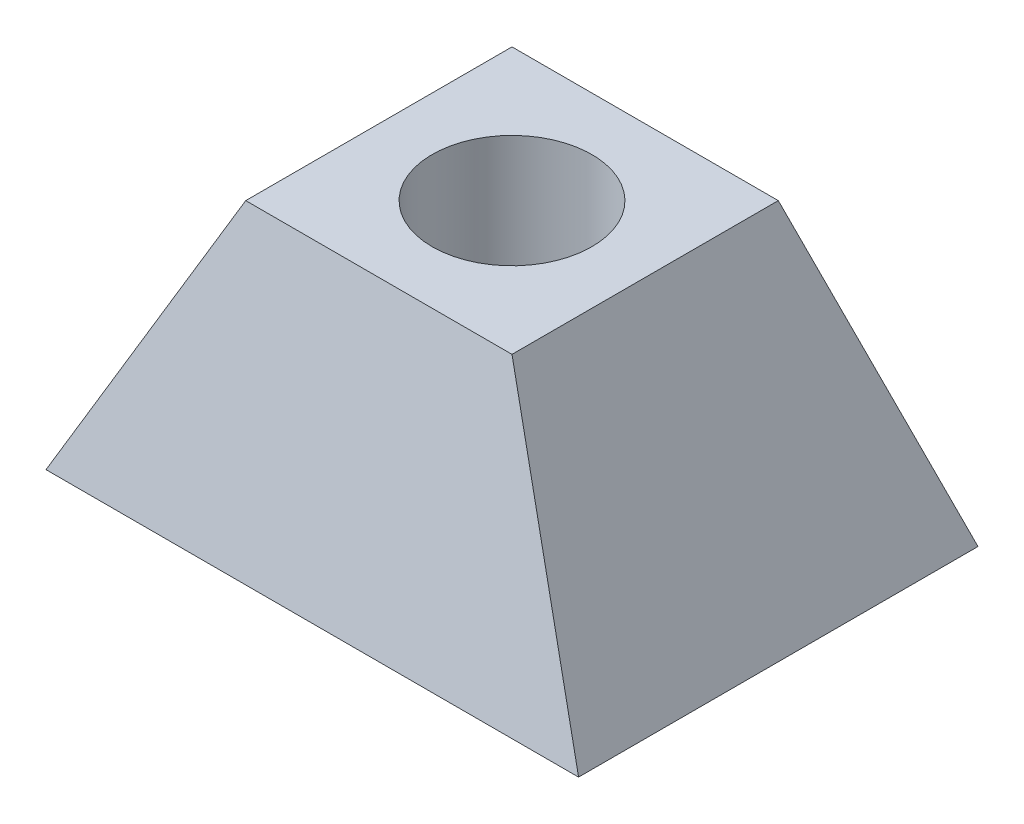
ISO-10303-21;
HEADER;
FILE_DESCRIPTION(('STEP AP214'),'2;1');
FILE_NAME('part.step','',(''),(''),'','','');
FILE_SCHEMA(('AUTOMOTIVE_DESIGN { 1 0 10303 214 1 1 1 1 }'));
ENDSEC;
DATA;
#1=APPLICATION_CONTEXT('core data for automotive mechanical design processes');
#2=APPLICATION_PROTOCOL_DEFINITION('international standard','automotive_design',2000,#1);
#3=PRODUCT_CONTEXT('',#1,'mechanical');
#4=PRODUCT('Part','Part','',(#3));
#5=PRODUCT_RELATED_PRODUCT_CATEGORY('part','',(#4));
#6=PRODUCT_DEFINITION_FORMATION('','',#4);
#7=PRODUCT_DEFINITION_CONTEXT('part definition',#1,'design');
#8=PRODUCT_DEFINITION('design','',#6,#7);
#9=PRODUCT_DEFINITION_SHAPE('','',#8);
#10=(LENGTH_UNIT() NAMED_UNIT(*) SI_UNIT(.MILLI.,.METRE.));
#11=(NAMED_UNIT(*) PLANE_ANGLE_UNIT() SI_UNIT($,.RADIAN.));
#12=(NAMED_UNIT(*) SI_UNIT($,.STERADIAN.) SOLID_ANGLE_UNIT());
#13=UNCERTAINTY_MEASURE_WITH_UNIT(LENGTH_MEASURE(1.E-05),#10,'distance_accuracy_value','');
#14=(GEOMETRIC_REPRESENTATION_CONTEXT(3) GLOBAL_UNCERTAINTY_ASSIGNED_CONTEXT((#13)) GLOBAL_UNIT_ASSIGNED_CONTEXT((#10,
#11,#12)) REPRESENTATION_CONTEXT('',''));
#15=CARTESIAN_POINT('',(0.,0.,0.));
#16=DIRECTION('',(0.,0.,1.));
#17=DIRECTION('',(1.,0.,0.));
#18=AXIS2_PLACEMENT_3D('',#15,#16,#17);
#19=CARTESIAN_POINT('',(0.,12.7,0.));
#20=DIRECTION('',(0.,-1.,0.));
#21=DIRECTION('',(0.,0.,-1.));
#22=AXIS2_PLACEMENT_3D('',#19,#20,#21);
#23=PLANE('',#22);
#24=CARTESIAN_POINT('',(0.,12.7,0.));
#25=DIRECTION('',(0.,1.,0.));
#26=DIRECTION('',(0.,0.,1.));
#27=AXIS2_PLACEMENT_3D('',#24,#25,#26);
#28=CIRCLE('',#27,3.81);
#29=CARTESIAN_POINT('',(0.,12.7,3.81));
#30=VERTEX_POINT('',#29);
#31=EDGE_CURVE('E264',#30,#30,#28,.T.);
#32=ORIENTED_EDGE('',*,*,#31,.F.);
#33=EDGE_LOOP('',(#32));
#34=FACE_BOUND('',#33,.T.);
#35=DIRECTION('',(0.,0.,-1.));
#36=VECTOR('',#35,1.);
#37=CARTESIAN_POINT('',(6.35,12.7,6.35));
#38=LINE('',#37,#36);
#39=CARTESIAN_POINT('',(6.35,12.7,6.35));
#40=VERTEX_POINT('',#39);
#41=CARTESIAN_POINT('',(6.35,12.7,-6.35));
#42=VERTEX_POINT('',#41);
#43=EDGE_CURVE('E224',#40,#42,#38,.T.);
#44=ORIENTED_EDGE('',*,*,#43,.T.);
#45=DIRECTION('',(-1.,0.,0.));
#46=VECTOR('',#45,1.);
#47=CARTESIAN_POINT('',(-6.35,12.7,-6.35));
#48=LINE('',#47,#46);
#49=CARTESIAN_POINT('',(-6.35,12.7,-6.35));
#50=VERTEX_POINT('',#49);
#51=EDGE_CURVE('E218',#42,#50,#48,.T.);
#52=ORIENTED_EDGE('',*,*,#51,.T.);
#53=DIRECTION('',(0.,0.,1.));
#54=VECTOR('',#53,1.);
#55=CARTESIAN_POINT('',(-6.35,12.7,6.35));
#56=LINE('',#55,#54);
#57=CARTESIAN_POINT('',(-6.35,12.7,6.35));
#58=VERTEX_POINT('',#57);
#59=EDGE_CURVE('E56',#50,#58,#56,.T.);
#60=ORIENTED_EDGE('',*,*,#59,.T.);
#61=DIRECTION('',(1.,0.,0.));
#62=VECTOR('',#61,1.);
#63=CARTESIAN_POINT('',(-6.35,12.7,6.35));
#64=LINE('',#63,#62);
#65=EDGE_CURVE('E12',#58,#40,#64,.T.);
#66=ORIENTED_EDGE('',*,*,#65,.T.);
#67=EDGE_LOOP('',(#44,#52,#60,#66));
#68=FACE_BOUND('',#67,.T.);
#69=ADVANCED_FACE('F47',(#34,#68),#23,.F.);
#70=CARTESIAN_POINT('',(0.,0.,0.));
#71=DIRECTION('',(0.,-1.,0.));
#72=DIRECTION('',(0.,0.,-1.));
#73=AXIS2_PLACEMENT_3D('',#70,#71,#72);
#74=PLANE('',#73);
#75=CARTESIAN_POINT('',(0.,0.,0.));
#76=DIRECTION('',(0.,-1.,0.));
#77=DIRECTION('',(0.,0.,-1.));
#78=AXIS2_PLACEMENT_3D('',#75,#76,#77);
#79=CIRCLE('',#78,3.81);
#80=CARTESIAN_POINT('',(0.,0.,3.81));
#81=VERTEX_POINT('',#80);
#82=EDGE_CURVE('E51',#81,#81,#79,.T.);
#83=ORIENTED_EDGE('',*,*,#82,.F.);
#84=EDGE_LOOP('',(#83));
#85=FACE_BOUND('',#84,.T.);
#86=DIRECTION('',(0.,0.,-1.));
#87=VECTOR('',#86,1.);
#88=CARTESIAN_POINT('',(12.7,0.,9.525));
#89=LINE('',#88,#87);
#90=CARTESIAN_POINT('',(12.7,0.,9.525));
#91=VERTEX_POINT('',#90);
#92=CARTESIAN_POINT('',(12.7,0.,-9.525));
#93=VERTEX_POINT('',#92);
#94=EDGE_CURVE('E114',#91,#93,#89,.T.);
#95=ORIENTED_EDGE('',*,*,#94,.F.);
#96=DIRECTION('',(1.,0.,0.));
#97=VECTOR('',#96,1.);
#98=CARTESIAN_POINT('',(-12.7,0.,9.525));
#99=LINE('',#98,#97);
#100=CARTESIAN_POINT('',(-12.7,0.,9.525));
#101=VERTEX_POINT('',#100);
#102=EDGE_CURVE('E98',#101,#91,#99,.T.);
#103=ORIENTED_EDGE('',*,*,#102,.F.);
#104=DIRECTION('',(0.,0.,1.));
#105=VECTOR('',#104,1.);
#106=CARTESIAN_POINT('',(-12.7,0.,9.525));
#107=LINE('',#106,#105);
#108=CARTESIAN_POINT('',(-12.7,0.,-9.525));
#109=VERTEX_POINT('',#108);
#110=EDGE_CURVE('E89',#109,#101,#107,.T.);
#111=ORIENTED_EDGE('',*,*,#110,.F.);
#112=DIRECTION('',(-1.,0.,0.));
#113=VECTOR('',#112,1.);
#114=CARTESIAN_POINT('',(-12.7,0.,-9.525));
#115=LINE('',#114,#113);
#116=EDGE_CURVE('E94',#93,#109,#115,.T.);
#117=ORIENTED_EDGE('',*,*,#116,.F.);
#118=EDGE_LOOP('',(#95,#103,#111,#117));
#119=FACE_BOUND('',#118,.T.);
#120=ADVANCED_FACE('F93',(#85,#119),#74,.T.);
#121=CARTESIAN_POINT('',(0.,2.24117647058823,-8.96470588235294));
#122=DIRECTION('',(0.,-0.242535625036333,0.970142500145332));
#123=DIRECTION('',(0.,-0.970142500145332,-0.242535625036333));
#124=AXIS2_PLACEMENT_3D('',#121,#122,#123);
#125=PLANE('',#124);
#126=DIRECTION('',(0.436435780471985,0.872871560943969,0.218217890235992));
#127=VECTOR('',#126,1.);
#128=CARTESIAN_POINT('',(-12.7,0.,-9.525));
#129=LINE('',#128,#127);
#130=EDGE_CURVE('E110',#109,#50,#129,.T.);
#131=ORIENTED_EDGE('',*,*,#130,.T.);
#132=ORIENTED_EDGE('',*,*,#51,.F.);
#133=DIRECTION('',(-0.436435780471985,0.87287156094397,0.218217890235992));
#134=VECTOR('',#133,1.);
#135=CARTESIAN_POINT('',(12.7,0.,-9.525));
#136=LINE('',#135,#134);
#137=EDGE_CURVE('E113',#93,#42,#136,.T.);
#138=ORIENTED_EDGE('',*,*,#137,.F.);
#139=ORIENTED_EDGE('',*,*,#116,.T.);
#140=EDGE_LOOP('',(#131,#132,#138,#139));
#141=FACE_BOUND('',#140,.T.);
#142=ADVANCED_FACE('F109',(#141),#125,.F.);
#143=CARTESIAN_POINT('',(10.16,5.08,0.));
#144=DIRECTION('',(-0.894427190999916,-0.447213595499958,0.));
#145=DIRECTION('',(0.447213595499958,-0.894427190999916,0.));
#146=AXIS2_PLACEMENT_3D('',#143,#144,#145);
#147=PLANE('',#146);
#148=ORIENTED_EDGE('',*,*,#137,.T.);
#149=ORIENTED_EDGE('',*,*,#43,.F.);
#150=DIRECTION('',(-0.436435780471985,0.872871560943969,-0.218217890235993));
#151=VECTOR('',#150,1.);
#152=CARTESIAN_POINT('',(12.7,0.,9.525));
#153=LINE('',#152,#151);
#154=EDGE_CURVE('E237',#91,#40,#153,.T.);
#155=ORIENTED_EDGE('',*,*,#154,.F.);
#156=ORIENTED_EDGE('',*,*,#94,.T.);
#157=EDGE_LOOP('',(#148,#149,#155,#156));
#158=FACE_BOUND('',#157,.T.);
#159=ADVANCED_FACE('F142',(#158),#147,.F.);
#160=CARTESIAN_POINT('',(-10.16,5.08,0.));
#161=DIRECTION('',(0.894427190999916,-0.447213595499958,0.));
#162=DIRECTION('',(0.447213595499958,0.894427190999916,0.));
#163=AXIS2_PLACEMENT_3D('',#160,#161,#162);
#164=PLANE('',#163);
#165=DIRECTION('',(0.436435780471985,0.872871560943969,-0.218217890235993));
#166=VECTOR('',#165,1.);
#167=CARTESIAN_POINT('',(-12.7,0.,9.525));
#168=LINE('',#167,#166);
#169=EDGE_CURVE('E71',#101,#58,#168,.T.);
#170=ORIENTED_EDGE('',*,*,#169,.T.);
#171=ORIENTED_EDGE('',*,*,#59,.F.);
#172=ORIENTED_EDGE('',*,*,#130,.F.);
#173=ORIENTED_EDGE('',*,*,#110,.T.);
#174=EDGE_LOOP('',(#170,#171,#172,#173));
#175=FACE_BOUND('',#174,.T.);
#176=ADVANCED_FACE('F118',(#175),#164,.F.);
#177=CARTESIAN_POINT('',(0.,2.24117647058824,8.96470588235294));
#178=DIRECTION('',(0.,-0.242535625036333,-0.970142500145332));
#179=DIRECTION('',(0.,0.970142500145332,-0.242535625036333));
#180=AXIS2_PLACEMENT_3D('',#177,#178,#179);
#181=PLANE('',#180);
#182=ORIENTED_EDGE('',*,*,#154,.T.);
#183=ORIENTED_EDGE('',*,*,#65,.F.);
#184=ORIENTED_EDGE('',*,*,#169,.F.);
#185=ORIENTED_EDGE('',*,*,#102,.T.);
#186=EDGE_LOOP('',(#182,#183,#184,#185));
#187=FACE_BOUND('',#186,.T.);
#188=ADVANCED_FACE('F141',(#187),#181,.F.);
#189=CARTESIAN_POINT('',(0.,-10.2127567069364,0.));
#190=DIRECTION('',(0.,1.,0.));
#191=DIRECTION('',(0.,0.,1.));
#192=AXIS2_PLACEMENT_3D('',#189,#190,#191);
#193=CYLINDRICAL_SURFACE('',#192,3.81);
#194=CARTESIAN_POINT('',(0.,0.,3.81));
#195=CARTESIAN_POINT('',(0.,0.132291666666668,3.81));
#196=CARTESIAN_POINT('',(0.,0.264583333333335,3.81));
#197=CARTESIAN_POINT('',(0.,0.529166666666668,3.81));
#198=CARTESIAN_POINT('',(0.,0.661458333333334,3.81));
#199=CARTESIAN_POINT('',(0.,0.926041666666668,3.81));
#200=CARTESIAN_POINT('',(0.,1.05833333333334,3.81));
#201=CARTESIAN_POINT('',(0.,1.32291666666667,3.81));
#202=CARTESIAN_POINT('',(0.,1.45520833333334,3.81));
#203=CARTESIAN_POINT('',(0.,1.71979166666667,3.81));
#204=CARTESIAN_POINT('',(0.,1.85208333333334,3.81));
#205=CARTESIAN_POINT('',(0.,2.11666666666667,3.81));
#206=CARTESIAN_POINT('',(0.,2.24895833333334,3.81));
#207=CARTESIAN_POINT('',(0.,2.51354166666667,3.81));
#208=CARTESIAN_POINT('',(0.,2.64583333333333,3.81));
#209=CARTESIAN_POINT('',(0.,2.91041666666667,3.81));
#210=CARTESIAN_POINT('',(0.,3.04270833333334,3.81));
#211=CARTESIAN_POINT('',(0.,3.30729166666667,3.81));
#212=CARTESIAN_POINT('',(0.,3.43958333333334,3.81));
#213=CARTESIAN_POINT('',(0.,3.70416666666667,3.81));
#214=CARTESIAN_POINT('',(0.,3.83645833333334,3.81));
#215=CARTESIAN_POINT('',(0.,4.10104166666667,3.81));
#216=CARTESIAN_POINT('',(0.,4.23333333333333,3.81));
#217=CARTESIAN_POINT('',(0.,4.49791666666667,3.81));
#218=CARTESIAN_POINT('',(0.,4.63020833333333,3.81));
#219=CARTESIAN_POINT('',(0.,4.89479166666667,3.81));
#220=CARTESIAN_POINT('',(0.,5.02708333333334,3.81));
#221=CARTESIAN_POINT('',(0.,5.29166666666667,3.81));
#222=CARTESIAN_POINT('',(0.,5.42395833333333,3.81));
#223=CARTESIAN_POINT('',(0.,5.68854166666667,3.81));
#224=CARTESIAN_POINT('',(0.,5.82083333333333,3.81));
#225=CARTESIAN_POINT('',(0.,6.08541666666667,3.81));
#226=CARTESIAN_POINT('',(0.,6.21770833333333,3.81));
#227=CARTESIAN_POINT('',(0.,6.48229166666667,3.81));
#228=CARTESIAN_POINT('',(0.,6.61458333333333,3.81));
#229=CARTESIAN_POINT('',(0.,6.87916666666667,3.81));
#230=CARTESIAN_POINT('',(0.,7.01145833333333,3.81));
#231=CARTESIAN_POINT('',(0.,7.27604166666667,3.81));
#232=CARTESIAN_POINT('',(0.,7.40833333333333,3.81));
#233=CARTESIAN_POINT('',(0.,7.67291666666667,3.81));
#234=CARTESIAN_POINT('',(0.,7.80520833333333,3.81));
#235=CARTESIAN_POINT('',(0.,8.06979166666667,3.81));
#236=CARTESIAN_POINT('',(0.,8.20208333333333,3.81));
#237=CARTESIAN_POINT('',(0.,8.46666666666667,3.81));
#238=CARTESIAN_POINT('',(0.,8.59895833333333,3.81));
#239=CARTESIAN_POINT('',(0.,8.86354166666666,3.81));
#240=CARTESIAN_POINT('',(0.,8.99583333333333,3.81));
#241=CARTESIAN_POINT('',(0.,9.26041666666666,3.81));
#242=CARTESIAN_POINT('',(0.,9.39270833333333,3.81));
#243=CARTESIAN_POINT('',(0.,9.65729166666667,3.81));
#244=CARTESIAN_POINT('',(0.,9.78958333333333,3.81));
#245=CARTESIAN_POINT('',(0.,10.0541666666667,3.81));
#246=CARTESIAN_POINT('',(0.,10.1864583333333,3.81));
#247=CARTESIAN_POINT('',(0.,10.4510416666667,3.81));
#248=CARTESIAN_POINT('',(0.,10.5833333333333,3.81));
#249=CARTESIAN_POINT('',(0.,10.8479166666667,3.81));
#250=CARTESIAN_POINT('',(0.,10.9802083333333,3.81));
#251=CARTESIAN_POINT('',(0.,11.2447916666667,3.81));
#252=CARTESIAN_POINT('',(0.,11.3770833333333,3.81));
#253=CARTESIAN_POINT('',(0.,11.6416666666667,3.81));
#254=CARTESIAN_POINT('',(0.,11.7739583333333,3.81));
#255=CARTESIAN_POINT('',(0.,12.0385416666667,3.81));
#256=CARTESIAN_POINT('',(0.,12.1708333333333,3.81));
#257=CARTESIAN_POINT('',(0.,12.4354166666667,3.81));
#258=CARTESIAN_POINT('',(0.,12.5677083333333,3.81));
#259=CARTESIAN_POINT('',(0.,12.7,3.81));
#260=B_SPLINE_CURVE_WITH_KNOTS('',3,(#194,#195,#196,#197,#198,#199,#200,#201,#202,#203,#204,
#205,#206,#207,#208,#209,#210,#211,#212,#213,#214,#215,#216,#217,#218,#219,#220,#221,#222,#223,
#224,#225,#226,#227,#228,#229,#230,#231,#232,#233,#234,#235,#236,#237,#238,#239,#240,#241,#242,
#243,#244,#245,#246,#247,#248,#249,#250,#251,#252,#253,#254,#255,#256,#257,#258,#259),
.UNSPECIFIED.,.F.,.F.,(4,2,2,2,2,2,2,2,2,2,2,2,2,2,2,2,2,2,2,2,2,2,2,2,2,2,2,2,2,2,2,2,4),(0.,
0.396875,0.793749999999999,1.190625,1.5875,1.984375,2.38125,2.778125,3.175,3.571875,3.96875,
4.365625,4.7625,5.159375,5.55625,5.953125,6.35,6.746875,7.14375,7.540625,7.9375,8.334375,
8.73125,9.128125,9.525,9.921875,10.31875,10.715625,11.1125,11.509375,11.90625,12.303125,12.7),.UNSPECIFIED.);
#261=EDGE_CURVE('BSEAM180',#81,#30,#260,.T.);
#262=ORIENTED_EDGE('',*,*,#82,.T.);
#263=ORIENTED_EDGE('',*,*,#31,.T.);
#264=ORIENTED_EDGE('',*,*,#261,.T.);
#265=ORIENTED_EDGE('',*,*,#261,.F.);
#266=EDGE_LOOP('',(#262,#264,#263,#265));
#267=FACE_BOUND('',#266,.T.);
#268=ADVANCED_FACE('F180',(#267),#193,.F.);
#269=CLOSED_SHELL('',(#69,#120,#142,#159,#176,#188,#268));
#270=MANIFOLD_SOLID_BREP('B2',#269);
#271=ADVANCED_BREP_SHAPE_REPRESENTATION('',(#18,#270),#14);
#272=SHAPE_DEFINITION_REPRESENTATION(#9,#271);
ENDSEC;
END-ISO-10303-21;
